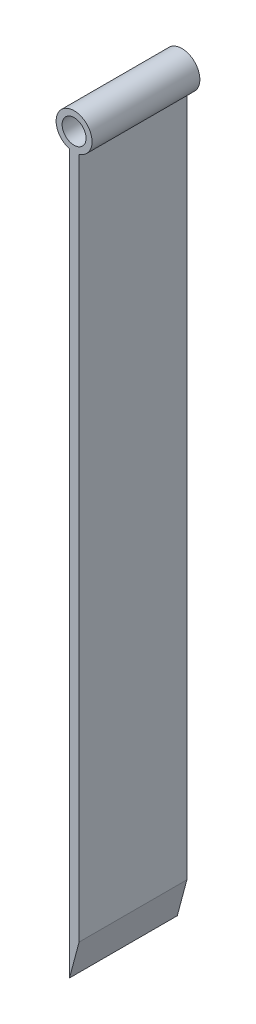
ISO-10303-21;
HEADER;
FILE_DESCRIPTION(('STEP AP214'),'2;1');
FILE_NAME('part.step','',(''),(''),'','','');
FILE_SCHEMA(('AUTOMOTIVE_DESIGN { 1 0 10303 214 1 1 1 1 }'));
ENDSEC;
DATA;
#1=APPLICATION_CONTEXT('core data for automotive mechanical design processes');
#2=APPLICATION_PROTOCOL_DEFINITION('international standard','automotive_design',2000,#1);
#3=PRODUCT_CONTEXT('',#1,'mechanical');
#4=PRODUCT('Part','Part','',(#3));
#5=PRODUCT_RELATED_PRODUCT_CATEGORY('part','',(#4));
#6=PRODUCT_DEFINITION_FORMATION('','',#4);
#7=PRODUCT_DEFINITION_CONTEXT('part definition',#1,'design');
#8=PRODUCT_DEFINITION('design','',#6,#7);
#9=PRODUCT_DEFINITION_SHAPE('','',#8);
#10=(LENGTH_UNIT() NAMED_UNIT(*) SI_UNIT(.MILLI.,.METRE.));
#11=(NAMED_UNIT(*) PLANE_ANGLE_UNIT() SI_UNIT($,.RADIAN.));
#12=(NAMED_UNIT(*) SI_UNIT($,.STERADIAN.) SOLID_ANGLE_UNIT());
#13=UNCERTAINTY_MEASURE_WITH_UNIT(LENGTH_MEASURE(1.E-05),#10,'distance_accuracy_value','');
#14=(GEOMETRIC_REPRESENTATION_CONTEXT(3) GLOBAL_UNCERTAINTY_ASSIGNED_CONTEXT((#13)) GLOBAL_UNIT_ASSIGNED_CONTEXT((#10,
#11,#12)) REPRESENTATION_CONTEXT('',''));
#15=CARTESIAN_POINT('',(0.,0.,0.));
#16=DIRECTION('',(0.,0.,1.));
#17=DIRECTION('',(1.,0.,0.));
#18=AXIS2_PLACEMENT_3D('',#15,#16,#17);
#19=CARTESIAN_POINT('',(0.957931978406358,153.5,22.5));
#20=DIRECTION('',(0.,0.,-1.));
#21=DIRECTION('',(-1.,0.,0.));
#22=AXIS2_PLACEMENT_3D('',#19,#20,#21);
#23=CYLINDRICAL_SURFACE('',#22,3.75);
#24=CARTESIAN_POINT('',(0.957931978406358,153.5,0.));
#25=DIRECTION('',(0.,0.,1.));
#26=DIRECTION('',(1.,0.,0.));
#27=AXIS2_PLACEMENT_3D('',#24,#25,#26);
#28=CIRCLE('',#27,3.75);
#29=CARTESIAN_POINT('',(1.99999999999999,149.897695981962,0.));
#30=VERTEX_POINT('',#29);
#31=CARTESIAN_POINT('',(0.,149.874415036888,0.));
#32=VERTEX_POINT('',#31);
#33=EDGE_CURVE('E102',#30,#32,#28,.T.);
#34=ORIENTED_EDGE('',*,*,#33,.T.);
#35=DIRECTION('',(0.,0.,-1.));
#36=VECTOR('',#35,1.);
#37=CARTESIAN_POINT('',(0.,149.874415036888,22.5));
#38=LINE('',#37,#36);
#39=CARTESIAN_POINT('',(0.,149.874415036888,22.5));
#40=VERTEX_POINT('',#39);
#41=EDGE_CURVE('E11',#40,#32,#38,.T.);
#42=ORIENTED_EDGE('',*,*,#41,.F.);
#43=CARTESIAN_POINT('',(0.957931978406358,153.5,22.5));
#44=DIRECTION('',(0.,0.,1.));
#45=DIRECTION('',(1.,0.,0.));
#46=AXIS2_PLACEMENT_3D('',#43,#44,#45);
#47=CIRCLE('',#46,3.75);
#48=CARTESIAN_POINT('',(1.99999999999999,149.897695981962,22.5));
#49=VERTEX_POINT('',#48);
#50=EDGE_CURVE('E87',#49,#40,#47,.T.);
#51=ORIENTED_EDGE('',*,*,#50,.F.);
#52=DIRECTION('',(0.,0.,-1.));
#53=VECTOR('',#52,1.);
#54=CARTESIAN_POINT('',(1.99999999999999,149.897695981962,22.5));
#55=LINE('',#54,#53);
#56=EDGE_CURVE('E95',#49,#30,#55,.T.);
#57=ORIENTED_EDGE('',*,*,#56,.T.);
#58=EDGE_LOOP('',(#34,#42,#51,#57));
#59=FACE_BOUND('',#58,.T.);
#60=ADVANCED_FACE('F35',(#59),#23,.T.);
#61=CARTESIAN_POINT('',(0.,0.,22.5));
#62=DIRECTION('',(1.,0.,0.));
#63=DIRECTION('',(0.,1.,0.));
#64=AXIS2_PLACEMENT_3D('',#61,#62,#63);
#65=PLANE('',#64);
#66=DIRECTION('',(0.,-1.,0.));
#67=VECTOR('',#66,1.);
#68=CARTESIAN_POINT('',(0.,0.,0.));
#69=LINE('',#68,#67);
#70=CARTESIAN_POINT('',(0.,0.,0.));
#71=VERTEX_POINT('',#70);
#72=EDGE_CURVE('E91',#32,#71,#69,.T.);
#73=ORIENTED_EDGE('',*,*,#72,.T.);
#74=DIRECTION('',(0.,0.,-1.));
#75=VECTOR('',#74,1.);
#76=CARTESIAN_POINT('',(0.,0.,22.5));
#77=LINE('',#76,#75);
#78=CARTESIAN_POINT('',(0.,0.,22.5));
#79=VERTEX_POINT('',#78);
#80=EDGE_CURVE('E44',#79,#71,#77,.T.);
#81=ORIENTED_EDGE('',*,*,#80,.F.);
#82=DIRECTION('',(0.,-1.,0.));
#83=VECTOR('',#82,1.);
#84=CARTESIAN_POINT('',(0.,0.,22.5));
#85=LINE('',#84,#83);
#86=EDGE_CURVE('E82',#40,#79,#85,.T.);
#87=ORIENTED_EDGE('',*,*,#86,.F.);
#88=ORIENTED_EDGE('',*,*,#41,.T.);
#89=EDGE_LOOP('',(#73,#81,#87,#88));
#90=FACE_BOUND('',#89,.T.);
#91=ADVANCED_FACE('F90',(#90),#65,.F.);
#92=CARTESIAN_POINT('',(0.,0.,22.5));
#93=DIRECTION('',(-0.966234939601246,0.257662650560332,0.));
#94=DIRECTION('',(-0.257662650560332,-0.966234939601246,0.));
#95=AXIS2_PLACEMENT_3D('',#92,#93,#94);
#96=PLANE('',#95);
#97=DIRECTION('',(0.257662650560332,0.966234939601246,0.));
#98=VECTOR('',#97,1.);
#99=CARTESIAN_POINT('',(0.,0.,0.));
#100=LINE('',#99,#98);
#101=CARTESIAN_POINT('',(2.,7.50000000000001,0.));
#102=VERTEX_POINT('',#101);
#103=EDGE_CURVE('E69',#71,#102,#100,.T.);
#104=ORIENTED_EDGE('',*,*,#103,.T.);
#105=DIRECTION('',(0.,0.,-1.));
#106=VECTOR('',#105,1.);
#107=CARTESIAN_POINT('',(2.,7.50000000000001,22.5));
#108=LINE('',#107,#106);
#109=CARTESIAN_POINT('',(2.,7.50000000000001,22.5));
#110=VERTEX_POINT('',#109);
#111=EDGE_CURVE('E92',#110,#102,#108,.T.);
#112=ORIENTED_EDGE('',*,*,#111,.F.);
#113=DIRECTION('',(0.257662650560332,0.966234939601246,0.));
#114=VECTOR('',#113,1.);
#115=CARTESIAN_POINT('',(0.,0.,22.5));
#116=LINE('',#115,#114);
#117=EDGE_CURVE('E85',#79,#110,#116,.T.);
#118=ORIENTED_EDGE('',*,*,#117,.F.);
#119=ORIENTED_EDGE('',*,*,#80,.T.);
#120=EDGE_LOOP('',(#104,#112,#118,#119));
#121=FACE_BOUND('',#120,.T.);
#122=ADVANCED_FACE('F93',(#121),#96,.F.);
#123=CARTESIAN_POINT('',(0.957931978406358,153.5,22.5));
#124=DIRECTION('',(0.,0.,-1.));
#125=DIRECTION('',(-1.,0.,0.));
#126=AXIS2_PLACEMENT_3D('',#123,#124,#125);
#127=CYLINDRICAL_SURFACE('',#126,2.5);
#128=CARTESIAN_POINT('',(0.957931978406358,153.5,22.5));
#129=DIRECTION('',(0.,0.,1.));
#130=DIRECTION('',(1.,0.,0.));
#131=AXIS2_PLACEMENT_3D('',#128,#129,#130);
#132=CIRCLE('',#131,2.5);
#133=CARTESIAN_POINT('',(3.45793197840636,153.5,22.5));
#134=VERTEX_POINT('',#133);
#135=EDGE_CURVE('E108',#134,#134,#132,.T.);
#136=ORIENTED_EDGE('',*,*,#135,.T.);
#137=EDGE_LOOP('',(#136));
#138=FACE_BOUND('',#137,.T.);
#139=CARTESIAN_POINT('',(0.957931978406358,153.5,0.));
#140=DIRECTION('',(0.,0.,1.));
#141=DIRECTION('',(1.,0.,0.));
#142=AXIS2_PLACEMENT_3D('',#139,#140,#141);
#143=CIRCLE('',#142,2.5);
#144=CARTESIAN_POINT('',(3.45793197840636,153.5,0.));
#145=VERTEX_POINT('',#144);
#146=EDGE_CURVE('E99',#145,#145,#143,.T.);
#147=ORIENTED_EDGE('',*,*,#146,.F.);
#148=EDGE_LOOP('',(#147));
#149=FACE_BOUND('',#148,.T.);
#150=ADVANCED_FACE('F37',(#138,#149),#127,.F.);
#151=CARTESIAN_POINT('',(2.,0.,22.5));
#152=DIRECTION('',(-1.,0.,0.));
#153=DIRECTION('',(0.,-1.,0.));
#154=AXIS2_PLACEMENT_3D('',#151,#152,#153);
#155=PLANE('',#154);
#156=DIRECTION('',(0.,1.,0.));
#157=VECTOR('',#156,1.);
#158=CARTESIAN_POINT('',(2.,0.,0.));
#159=LINE('',#158,#157);
#160=EDGE_CURVE('E75',#102,#30,#159,.T.);
#161=ORIENTED_EDGE('',*,*,#160,.T.);
#162=ORIENTED_EDGE('',*,*,#56,.F.);
#163=DIRECTION('',(0.,1.,0.));
#164=VECTOR('',#163,1.);
#165=CARTESIAN_POINT('',(2.,0.,22.5));
#166=LINE('',#165,#164);
#167=EDGE_CURVE('E52',#110,#49,#166,.T.);
#168=ORIENTED_EDGE('',*,*,#167,.F.);
#169=ORIENTED_EDGE('',*,*,#111,.T.);
#170=EDGE_LOOP('',(#161,#162,#168,#169));
#171=FACE_BOUND('',#170,.T.);
#172=ADVANCED_FACE('F110',(#171),#155,.F.);
#173=CARTESIAN_POINT('',(0.,0.,22.5));
#174=DIRECTION('',(0.,0.,1.));
#175=DIRECTION('',(1.,0.,0.));
#176=AXIS2_PLACEMENT_3D('',#173,#174,#175);
#177=PLANE('',#176);
#178=ORIENTED_EDGE('',*,*,#135,.F.);
#179=EDGE_LOOP('',(#178));
#180=FACE_BOUND('',#179,.T.);
#181=ORIENTED_EDGE('',*,*,#50,.T.);
#182=ORIENTED_EDGE('',*,*,#86,.T.);
#183=ORIENTED_EDGE('',*,*,#117,.T.);
#184=ORIENTED_EDGE('',*,*,#167,.T.);
#185=EDGE_LOOP('',(#181,#182,#183,#184));
#186=FACE_BOUND('',#185,.T.);
#187=ADVANCED_FACE('F83',(#180,#186),#177,.T.);
#188=CARTESIAN_POINT('',(0.,0.,0.));
#189=DIRECTION('',(0.,0.,1.));
#190=DIRECTION('',(1.,0.,0.));
#191=AXIS2_PLACEMENT_3D('',#188,#189,#190);
#192=PLANE('',#191);
#193=ORIENTED_EDGE('',*,*,#146,.T.);
#194=EDGE_LOOP('',(#193));
#195=FACE_BOUND('',#194,.T.);
#196=ORIENTED_EDGE('',*,*,#33,.F.);
#197=ORIENTED_EDGE('',*,*,#160,.F.);
#198=ORIENTED_EDGE('',*,*,#103,.F.);
#199=ORIENTED_EDGE('',*,*,#72,.F.);
#200=EDGE_LOOP('',(#196,#197,#198,#199));
#201=FACE_BOUND('',#200,.T.);
#202=ADVANCED_FACE('F113',(#195,#201),#192,.F.);
#203=CLOSED_SHELL('',(#60,#91,#122,#150,#172,#187,#202));
#204=MANIFOLD_SOLID_BREP('B2',#203);
#205=ADVANCED_BREP_SHAPE_REPRESENTATION('',(#18,#204),#14);
#206=SHAPE_DEFINITION_REPRESENTATION(#9,#205);
ENDSEC;
END-ISO-10303-21;
